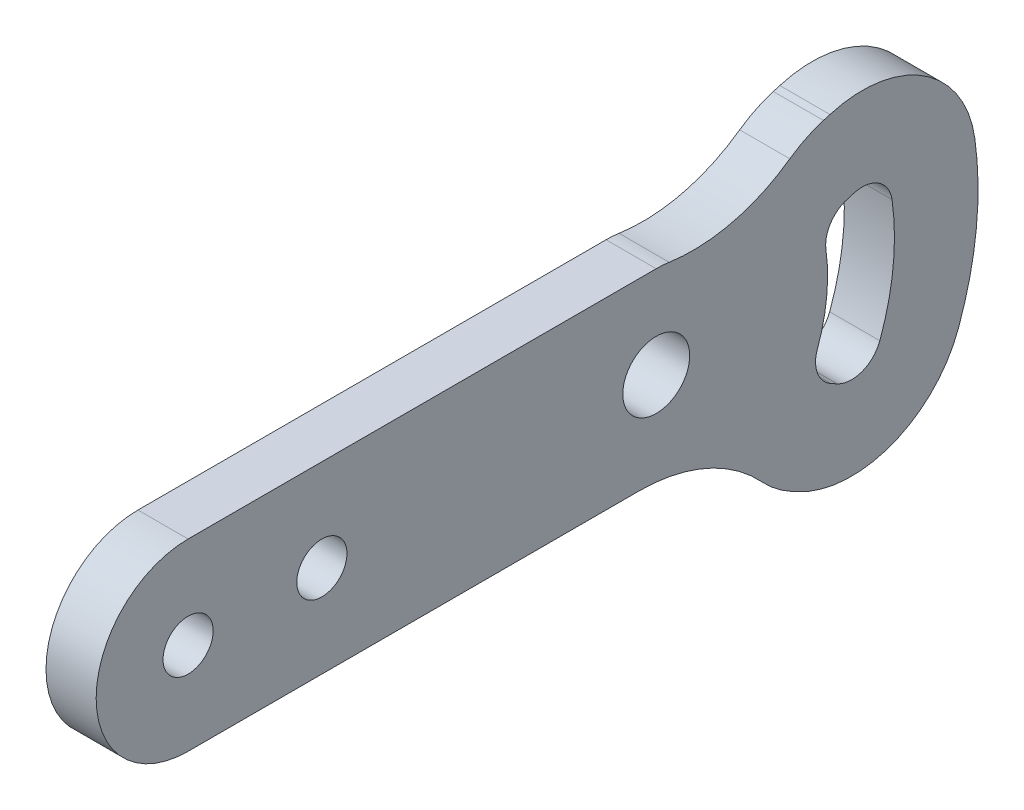
ISO-10303-21;
HEADER;
FILE_DESCRIPTION(('STEP AP214'),'2;1');
FILE_NAME('part.step','',(''),(''),'','','');
FILE_SCHEMA(('AUTOMOTIVE_DESIGN { 1 0 10303 214 1 1 1 1 }'));
ENDSEC;
DATA;
#1=APPLICATION_CONTEXT('core data for automotive mechanical design processes');
#2=APPLICATION_PROTOCOL_DEFINITION('international standard','automotive_design',2000,#1);
#3=PRODUCT_CONTEXT('',#1,'mechanical');
#4=PRODUCT('Part','Part','',(#3));
#5=PRODUCT_RELATED_PRODUCT_CATEGORY('part','',(#4));
#6=PRODUCT_DEFINITION_FORMATION('','',#4);
#7=PRODUCT_DEFINITION_CONTEXT('part definition',#1,'design');
#8=PRODUCT_DEFINITION('design','',#6,#7);
#9=PRODUCT_DEFINITION_SHAPE('','',#8);
#10=(LENGTH_UNIT() NAMED_UNIT(*) SI_UNIT(.MILLI.,.METRE.));
#11=(NAMED_UNIT(*) PLANE_ANGLE_UNIT() SI_UNIT($,.RADIAN.));
#12=(NAMED_UNIT(*) SI_UNIT($,.STERADIAN.) SOLID_ANGLE_UNIT());
#13=UNCERTAINTY_MEASURE_WITH_UNIT(LENGTH_MEASURE(1.E-05),#10,'distance_accuracy_value','');
#14=(GEOMETRIC_REPRESENTATION_CONTEXT(3) GLOBAL_UNCERTAINTY_ASSIGNED_CONTEXT((#13)) GLOBAL_UNIT_ASSIGNED_CONTEXT((#10,
#11,#12)) REPRESENTATION_CONTEXT('',''));
#15=CARTESIAN_POINT('',(0.,0.,0.));
#16=DIRECTION('',(0.,0.,1.));
#17=DIRECTION('',(1.,0.,0.));
#18=AXIS2_PLACEMENT_3D('',#15,#16,#17);
#19=CARTESIAN_POINT('',(3.,-4.10338121412378,-39.3298174129849));
#20=DIRECTION('',(-1.,0.,0.));
#21=DIRECTION('',(0.,0.,1.));
#22=AXIS2_PLACEMENT_3D('',#19,#20,#21);
#23=CYLINDRICAL_SURFACE('',#22,6.79999999999999);
#24=CARTESIAN_POINT('',(3.,-4.10338121412378,-39.3298174129849));
#25=DIRECTION('',(1.,0.,0.));
#26=DIRECTION('',(0.,0.,-1.));
#27=AXIS2_PLACEMENT_3D('',#24,#25,#26);
#28=CIRCLE('',#27,6.79999999999999);
#29=CARTESIAN_POINT('',(3.,-8.71629834174034,-34.3337193781439));
#30=VERTEX_POINT('',#29);
#31=CARTESIAN_POINT('',(3.,-10.0793375802251,-36.0851378432196));
#32=VERTEX_POINT('',#31);
#33=EDGE_CURVE('E299',#30,#32,#28,.T.);
#34=ORIENTED_EDGE('',*,*,#33,.F.);
#35=DIRECTION('',(-1.,0.,0.));
#36=VECTOR('',#35,1.);
#37=CARTESIAN_POINT('',(3.,-8.71629834174034,-34.3337193781439));
#38=LINE('',#37,#36);
#39=CARTESIAN_POINT('',(0.,-8.71629834174034,-34.3337193781439));
#40=VERTEX_POINT('',#39);
#41=EDGE_CURVE('E371',#30,#40,#38,.T.);
#42=ORIENTED_EDGE('',*,*,#41,.T.);
#43=CARTESIAN_POINT('',(0.,-4.10338121412378,-39.3298174129849));
#44=DIRECTION('',(1.,0.,0.));
#45=DIRECTION('',(0.,0.,-1.));
#46=AXIS2_PLACEMENT_3D('',#43,#44,#45);
#47=CIRCLE('',#46,6.79999999999999);
#48=CARTESIAN_POINT('',(0.,-10.0793375802251,-36.0851378432196));
#49=VERTEX_POINT('',#48);
#50=EDGE_CURVE('E339',#40,#49,#47,.T.);
#51=ORIENTED_EDGE('',*,*,#50,.T.);
#52=DIRECTION('',(-1.,0.,0.));
#53=VECTOR('',#52,1.);
#54=CARTESIAN_POINT('',(3.,-10.0793375802251,-36.0851378432196));
#55=LINE('',#54,#53);
#56=EDGE_CURVE('E368',#32,#49,#55,.T.);
#57=ORIENTED_EDGE('',*,*,#56,.F.);
#58=EDGE_LOOP('',(#34,#42,#51,#57));
#59=FACE_BOUND('',#58,.T.);
#60=ADVANCED_FACE('F116',(#59),#23,.T.);
#61=CARTESIAN_POINT('',(3.,7.34730238792617,-3.98925970849164));
#62=DIRECTION('',(0.,0.878817112661964,-0.477158760259611));
#63=DIRECTION('',(0.,0.477158760259611,0.878817112661964));
#64=AXIS2_PLACEMENT_3D('',#61,#62,#63);
#65=PLANE('',#64);
#66=DIRECTION('',(0.,-0.477158760259611,-0.878817112661964));
#67=VECTOR('',#66,1.);
#68=CARTESIAN_POINT('',(0.,7.34730238792617,-3.98925970849164));
#69=LINE('',#68,#67);
#70=CARTESIAN_POINT('',(0.,-10.2722961094085,-36.4405232444814));
#71=VERTEX_POINT('',#70);
#72=EDGE_CURVE('E341',#49,#71,#69,.T.);
#73=ORIENTED_EDGE('',*,*,#72,.T.);
#74=DIRECTION('',(-1.,0.,0.));
#75=VECTOR('',#74,1.);
#76=CARTESIAN_POINT('',(3.,-10.2722961094085,-36.4405232444814));
#77=LINE('',#76,#75);
#78=CARTESIAN_POINT('',(3.,-10.2722961094085,-36.4405232444814));
#79=VERTEX_POINT('',#78);
#80=EDGE_CURVE('E365',#79,#71,#77,.T.);
#81=ORIENTED_EDGE('',*,*,#80,.F.);
#82=DIRECTION('',(0.,-0.477158760259611,-0.878817112661964));
#83=VECTOR('',#82,1.);
#84=CARTESIAN_POINT('',(3.,7.34730238792617,-3.98925970849164));
#85=LINE('',#84,#83);
#86=EDGE_CURVE('E301',#32,#79,#85,.T.);
#87=ORIENTED_EDGE('',*,*,#86,.F.);
#88=ORIENTED_EDGE('',*,*,#56,.T.);
#89=EDGE_LOOP('',(#73,#81,#87,#88));
#90=FACE_BOUND('',#89,.T.);
#91=ADVANCED_FACE('F492',(#90),#65,.F.);
#92=CARTESIAN_POINT('',(3.,-4.29633974330718,-39.6852028142467));
#93=DIRECTION('',(-1.,0.,0.));
#94=DIRECTION('',(0.,0.,1.));
#95=AXIS2_PLACEMENT_3D('',#92,#93,#94);
#96=CYLINDRICAL_SURFACE('',#95,6.8);
#97=CARTESIAN_POINT('',(0.,-4.29633974330718,-39.6852028142467));
#98=DIRECTION('',(1.,0.,0.));
#99=DIRECTION('',(0.,0.,-1.));
#100=AXIS2_PLACEMENT_3D('',#97,#98,#99);
#101=CIRCLE('',#100,6.8);
#102=CARTESIAN_POINT('',(0.,-6.64293494447094,-46.0674822629919));
#103=VERTEX_POINT('',#102);
#104=EDGE_CURVE('E344',#71,#103,#101,.T.);
#105=ORIENTED_EDGE('',*,*,#104,.T.);
#106=DIRECTION('',(-1.,0.,0.));
#107=VECTOR('',#106,1.);
#108=CARTESIAN_POINT('',(3.,-6.64293494447094,-46.0674822629919));
#109=LINE('',#108,#107);
#110=CARTESIAN_POINT('',(3.,-6.64293494447094,-46.0674822629919));
#111=VERTEX_POINT('',#110);
#112=EDGE_CURVE('E362',#111,#103,#109,.T.);
#113=ORIENTED_EDGE('',*,*,#112,.F.);
#114=CARTESIAN_POINT('',(3.,-4.29633974330718,-39.6852028142467));
#115=DIRECTION('',(1.,0.,0.));
#116=DIRECTION('',(0.,0.,-1.));
#117=AXIS2_PLACEMENT_3D('',#114,#115,#116);
#118=CIRCLE('',#117,6.8);
#119=EDGE_CURVE('E304',#79,#111,#118,.T.);
#120=ORIENTED_EDGE('',*,*,#119,.F.);
#121=ORIENTED_EDGE('',*,*,#80,.T.);
#122=EDGE_LOOP('',(#105,#113,#120,#121));
#123=FACE_BOUND('',#122,.T.);
#124=ADVANCED_FACE('F489',(#123),#96,.T.);
#125=CARTESIAN_POINT('',(3.,0.,-28.));
#126=DIRECTION('',(-1.,0.,0.));
#127=DIRECTION('',(0.,0.,1.));
#128=AXIS2_PLACEMENT_3D('',#125,#126,#127);
#129=CYLINDRICAL_SURFACE('',#128,19.25);
#130=CARTESIAN_POINT('',(0.,0.,-28.));
#131=DIRECTION('',(1.,0.,0.));
#132=DIRECTION('',(0.,0.,-1.));
#133=AXIS2_PLACEMENT_3D('',#130,#131,#132);
#134=CIRCLE('',#133,19.25);
#135=CARTESIAN_POINT('',(0.,2.74133009164647,-47.0538082631435));
#136=VERTEX_POINT('',#135);
#137=EDGE_CURVE('E347',#103,#136,#134,.T.);
#138=ORIENTED_EDGE('',*,*,#137,.T.);
#139=DIRECTION('',(-1.,0.,0.));
#140=VECTOR('',#139,1.);
#141=CARTESIAN_POINT('',(3.,2.74133009164647,-47.0538082631435));
#142=LINE('',#141,#140);
#143=CARTESIAN_POINT('',(3.,2.74133009164647,-47.0538082631435));
#144=VERTEX_POINT('',#143);
#145=EDGE_CURVE('E360',#144,#136,#142,.T.);
#146=ORIENTED_EDGE('',*,*,#145,.F.);
#147=CARTESIAN_POINT('',(3.,0.,-28.));
#148=DIRECTION('',(1.,0.,0.));
#149=DIRECTION('',(0.,0.,-1.));
#150=AXIS2_PLACEMENT_3D('',#147,#148,#149);
#151=CIRCLE('',#150,19.25);
#152=EDGE_CURVE('E307',#111,#144,#151,.T.);
#153=ORIENTED_EDGE('',*,*,#152,.F.);
#154=ORIENTED_EDGE('',*,*,#112,.T.);
#155=EDGE_LOOP('',(#138,#146,#153,#154));
#156=FACE_BOUND('',#155,.T.);
#157=ADVANCED_FACE('F487',(#156),#129,.T.);
#158=CARTESIAN_POINT('',(3.,1.77296413719473,-40.3231123572019));
#159=DIRECTION('',(-1.,0.,0.));
#160=DIRECTION('',(0.,0.,1.));
#161=AXIS2_PLACEMENT_3D('',#158,#159,#160);
#162=CYLINDRICAL_SURFACE('',#161,6.8);
#163=CARTESIAN_POINT('',(0.,1.77296413719473,-40.3231123572019));
#164=DIRECTION('',(1.,0.,0.));
#165=DIRECTION('',(0.,0.,-1.));
#166=AXIS2_PLACEMENT_3D('',#163,#164,#165);
#167=CIRCLE('',#166,6.8);
#168=CARTESIAN_POINT('',(0.,8.29293833429844,-38.3918080132152));
#169=VERTEX_POINT('',#168);
#170=EDGE_CURVE('E350',#169,#136,#167,.F.);
#171=ORIENTED_EDGE('',*,*,#170,.F.);
#172=DIRECTION('',(-1.,0.,0.));
#173=VECTOR('',#172,1.);
#174=CARTESIAN_POINT('',(3.,8.29293833429844,-38.3918080132152));
#175=LINE('',#174,#173);
#176=CARTESIAN_POINT('',(3.,8.29293833429844,-38.3918080132152));
#177=VERTEX_POINT('',#176);
#178=EDGE_CURVE('E358',#177,#169,#175,.T.);
#179=ORIENTED_EDGE('',*,*,#178,.F.);
#180=CARTESIAN_POINT('',(3.,1.77296413719473,-40.3231123572019));
#181=DIRECTION('',(1.,0.,0.));
#182=DIRECTION('',(0.,0.,-1.));
#183=AXIS2_PLACEMENT_3D('',#180,#181,#182);
#184=CIRCLE('',#183,6.8);
#185=EDGE_CURVE('E309',#177,#144,#184,.F.);
#186=ORIENTED_EDGE('',*,*,#185,.T.);
#187=ORIENTED_EDGE('',*,*,#145,.T.);
#188=EDGE_LOOP('',(#171,#179,#186,#187));
#189=FACE_BOUND('',#188,.T.);
#190=ADVANCED_FACE('F483',(#189),#162,.T.);
#191=CARTESIAN_POINT('',(3.,-2.83084781586939,-0.838535325244442));
#192=DIRECTION('',(0.,0.958819734868193,0.284015344703922));
#193=DIRECTION('',(0.,-0.284015344703922,0.958819734868193));
#194=AXIS2_PLACEMENT_3D('',#191,#192,#193);
#195=PLANE('',#194);
#196=DIRECTION('',(0.,0.284015344703922,-0.958819734868193));
#197=VECTOR('',#196,1.);
#198=CARTESIAN_POINT('',(0.,-2.83084781586939,-0.838535325244442));
#199=LINE('',#198,#197);
#200=CARTESIAN_POINT('',(0.,8.17808519160487,-38.0040703015749));
#201=VERTEX_POINT('',#200);
#202=EDGE_CURVE('E353',#201,#169,#199,.T.);
#203=ORIENTED_EDGE('',*,*,#202,.F.);
#204=DIRECTION('',(-1.,0.,0.));
#205=VECTOR('',#204,1.);
#206=CARTESIAN_POINT('',(3.,8.17808519160487,-38.0040703015749));
#207=LINE('',#206,#205);
#208=CARTESIAN_POINT('',(3.,8.17808519160487,-38.0040703015749));
#209=VERTEX_POINT('',#208);
#210=EDGE_CURVE('E270',#209,#201,#207,.T.);
#211=ORIENTED_EDGE('',*,*,#210,.F.);
#212=DIRECTION('',(0.,0.284015344703922,-0.958819734868193));
#213=VECTOR('',#212,1.);
#214=CARTESIAN_POINT('',(3.,-2.83084781586939,-0.838535325244442));
#215=LINE('',#214,#213);
#216=EDGE_CURVE('E312',#209,#177,#215,.T.);
#217=ORIENTED_EDGE('',*,*,#216,.T.);
#218=ORIENTED_EDGE('',*,*,#178,.T.);
#219=EDGE_LOOP('',(#203,#211,#217,#218));
#220=FACE_BOUND('',#219,.T.);
#221=ADVANCED_FACE('F480',(#220),#195,.T.);
#222=CARTESIAN_POINT('',(3.,1.65811099450116,-39.9353746455616));
#223=DIRECTION('',(-1.,0.,0.));
#224=DIRECTION('',(0.,0.,1.));
#225=AXIS2_PLACEMENT_3D('',#222,#223,#224);
#226=CYLINDRICAL_SURFACE('',#225,6.8);
#227=CARTESIAN_POINT('',(0.,1.65811099450116,-39.9353746455616));
#228=DIRECTION('',(1.,0.,0.));
#229=DIRECTION('',(0.,0.,-1.));
#230=AXIS2_PLACEMENT_3D('',#227,#228,#229);
#231=CIRCLE('',#230,6.8);
#232=CARTESIAN_POINT('',(0.,7.19771983883198,-35.9916791892907));
#233=VERTEX_POINT('',#232);
#234=EDGE_CURVE('E282',#201,#233,#231,.T.);
#235=ORIENTED_EDGE('',*,*,#234,.T.);
#236=DIRECTION('',(-1.,0.,0.));
#237=VECTOR('',#236,1.);
#238=CARTESIAN_POINT('',(3.,7.19771983883197,-35.9916791892907));
#239=LINE('',#238,#237);
#240=CARTESIAN_POINT('',(3.,7.19771983883198,-35.9916791892907));
#241=VERTEX_POINT('',#240);
#242=EDGE_CURVE('E131',#233,#241,#239,.F.);
#243=ORIENTED_EDGE('',*,*,#242,.T.);
#244=CARTESIAN_POINT('',(3.,1.65811099450116,-39.9353746455616));
#245=DIRECTION('',(1.,0.,0.));
#246=DIRECTION('',(0.,0.,-1.));
#247=AXIS2_PLACEMENT_3D('',#244,#245,#246);
#248=CIRCLE('',#247,6.8);
#249=EDGE_CURVE('E315',#209,#241,#248,.T.);
#250=ORIENTED_EDGE('',*,*,#249,.F.);
#251=ORIENTED_EDGE('',*,*,#210,.T.);
#252=EDGE_LOOP('',(#235,#243,#250,#251));
#253=FACE_BOUND('',#252,.T.);
#254=ADVANCED_FACE('F477',(#253),#226,.T.);
#255=CARTESIAN_POINT('',(3.,11.7413879512359,-6.37505350978958));
#256=DIRECTION('',(0.,0.878817112661966,-0.477158760259608));
#257=DIRECTION('',(0.,0.477158760259608,0.878817112661966));
#258=AXIS2_PLACEMENT_3D('',#255,#256,#257);
#259=PLANE('',#258);
#260=DIRECTION('',(0.,-0.477158760259608,-0.878817112661966));
#261=VECTOR('',#260,1.);
#262=CARTESIAN_POINT('',(0.,11.7413879512359,-6.37505350978958));
#263=LINE('',#262,#261);
#264=CARTESIAN_POINT('',(0.,-5.68525201691532,-38.4709316445176));
#265=VERTEX_POINT('',#264);
#266=CARTESIAN_POINT('',(0.,-5.87821054609872,-38.8263170457794));
#267=VERTEX_POINT('',#266);
#268=EDGE_CURVE('E319',#265,#267,#263,.T.);
#269=ORIENTED_EDGE('',*,*,#268,.F.);
#270=DIRECTION('',(-1.,0.,0.));
#271=VECTOR('',#270,1.);
#272=CARTESIAN_POINT('',(3.,-5.68525201691532,-38.4709316445176));
#273=LINE('',#272,#271);
#274=CARTESIAN_POINT('',(3.,-5.68525201691532,-38.4709316445176));
#275=VERTEX_POINT('',#274);
#276=EDGE_CURVE('E271',#275,#265,#273,.T.);
#277=ORIENTED_EDGE('',*,*,#276,.F.);
#278=DIRECTION('',(0.,-0.477158760259608,-0.878817112661966));
#279=VECTOR('',#278,1.);
#280=CARTESIAN_POINT('',(3.,11.7413879512359,-6.37505350978958));
#281=LINE('',#280,#279);
#282=CARTESIAN_POINT('',(3.,-5.87821054609872,-38.8263170457794));
#283=VERTEX_POINT('',#282);
#284=EDGE_CURVE('E278',#275,#283,#281,.T.);
#285=ORIENTED_EDGE('',*,*,#284,.T.);
#286=DIRECTION('',(-1.,0.,0.));
#287=VECTOR('',#286,1.);
#288=CARTESIAN_POINT('',(3.,-5.87821054609872,-38.8263170457794));
#289=LINE('',#288,#287);
#290=EDGE_CURVE('E259',#283,#267,#289,.T.);
#291=ORIENTED_EDGE('',*,*,#290,.T.);
#292=EDGE_LOOP('',(#269,#277,#285,#291));
#293=FACE_BOUND('',#292,.T.);
#294=ADVANCED_FACE('F284',(#293),#259,.T.);
#295=CARTESIAN_POINT('',(3.,-4.10338121412378,-39.3298174129849));
#296=DIRECTION('',(-1.,0.,0.));
#297=DIRECTION('',(0.,0.,1.));
#298=AXIS2_PLACEMENT_3D('',#295,#296,#297);
#299=CYLINDRICAL_SURFACE('',#298,1.8);
#300=CARTESIAN_POINT('',(0.,-4.10338121412378,-39.3298174129849));
#301=DIRECTION('',(1.,0.,0.));
#302=DIRECTION('',(0.,0.,-1.));
#303=AXIS2_PLACEMENT_3D('',#300,#301,#302);
#304=CIRCLE('',#303,1.8);
#305=CARTESIAN_POINT('',(0.,-3.49042800371525,-37.6373965546137));
#306=VERTEX_POINT('',#305);
#307=EDGE_CURVE('E322',#306,#265,#304,.T.);
#308=ORIENTED_EDGE('',*,*,#307,.F.);
#309=DIRECTION('',(-1.,0.,0.));
#310=VECTOR('',#309,1.);
#311=CARTESIAN_POINT('',(3.,-3.49042800371525,-37.6373965546137));
#312=LINE('',#311,#310);
#313=CARTESIAN_POINT('',(3.,-3.49042800371525,-37.6373965546137));
#314=VERTEX_POINT('',#313);
#315=EDGE_CURVE('E382',#314,#306,#312,.T.);
#316=ORIENTED_EDGE('',*,*,#315,.F.);
#317=CARTESIAN_POINT('',(3.,-4.10338121412378,-39.3298174129849));
#318=DIRECTION('',(1.,0.,0.));
#319=DIRECTION('',(0.,0.,-1.));
#320=AXIS2_PLACEMENT_3D('',#317,#318,#319);
#321=CIRCLE('',#320,1.8);
#322=EDGE_CURVE('E285',#314,#275,#321,.T.);
#323=ORIENTED_EDGE('',*,*,#322,.T.);
#324=ORIENTED_EDGE('',*,*,#276,.T.);
#325=EDGE_LOOP('',(#308,#316,#323,#324));
#326=FACE_BOUND('',#325,.T.);
#327=ADVANCED_FACE('F522',(#326),#299,.F.);
#328=CARTESIAN_POINT('',(3.,0.,-28.));
#329=DIRECTION('',(-1.,0.,0.));
#330=DIRECTION('',(0.,0.,1.));
#331=AXIS2_PLACEMENT_3D('',#328,#329,#330);
#332=CYLINDRICAL_SURFACE('',#331,10.25);
#333=CARTESIAN_POINT('',(0.,0.,-28.));
#334=DIRECTION('',(1.,0.,0.));
#335=DIRECTION('',(0.,0.,-1.));
#336=AXIS2_PLACEMENT_3D('',#333,#334,#335);
#337=CIRCLE('',#336,10.25);
#338=CARTESIAN_POINT('',(0.,1.41042636461717,-38.1524971051457));
#339=VERTEX_POINT('',#338);
#340=EDGE_CURVE('E325',#306,#339,#337,.T.);
#341=ORIENTED_EDGE('',*,*,#340,.T.);
#342=DIRECTION('',(-1.,0.,0.));
#343=VECTOR('',#342,1.);
#344=CARTESIAN_POINT('',(3.,1.41042636461717,-38.1524971051457));
#345=LINE('',#344,#343);
#346=CARTESIAN_POINT('',(3.,1.41042636461717,-38.1524971051457));
#347=VERTEX_POINT('',#346);
#348=EDGE_CURVE('E380',#347,#339,#345,.T.);
#349=ORIENTED_EDGE('',*,*,#348,.F.);
#350=CARTESIAN_POINT('',(3.,0.,-28.));
#351=DIRECTION('',(1.,0.,0.));
#352=DIRECTION('',(0.,0.,-1.));
#353=AXIS2_PLACEMENT_3D('',#350,#351,#352);
#354=CIRCLE('',#353,10.25);
#355=EDGE_CURVE('E287',#314,#347,#354,.T.);
#356=ORIENTED_EDGE('',*,*,#355,.F.);
#357=ORIENTED_EDGE('',*,*,#315,.T.);
#358=EDGE_LOOP('',(#341,#349,#356,#357));
#359=FACE_BOUND('',#358,.T.);
#360=ADVANCED_FACE('F518',(#359),#332,.T.);
#361=CARTESIAN_POINT('',(3.,1.65811099450116,-39.9353746455616));
#362=DIRECTION('',(-1.,0.,0.));
#363=DIRECTION('',(0.,0.,1.));
#364=AXIS2_PLACEMENT_3D('',#361,#362,#363);
#365=CYLINDRICAL_SURFACE('',#364,1.8);
#366=CARTESIAN_POINT('',(0.,1.65811099450116,-39.9353746455616));
#367=DIRECTION('',(1.,0.,0.));
#368=DIRECTION('',(0.,0.,-1.));
#369=AXIS2_PLACEMENT_3D('',#366,#367,#368);
#370=CIRCLE('',#369,1.8);
#371=CARTESIAN_POINT('',(0.,3.3839865172639,-39.4241470250945));
#372=VERTEX_POINT('',#371);
#373=EDGE_CURVE('E328',#372,#339,#370,.T.);
#374=ORIENTED_EDGE('',*,*,#373,.F.);
#375=DIRECTION('',(-1.,0.,0.));
#376=VECTOR('',#375,1.);
#377=CARTESIAN_POINT('',(3.,3.3839865172639,-39.4241470250945));
#378=LINE('',#377,#376);
#379=CARTESIAN_POINT('',(3.,3.3839865172639,-39.4241470250945));
#380=VERTEX_POINT('',#379);
#381=EDGE_CURVE('E378',#380,#372,#378,.T.);
#382=ORIENTED_EDGE('',*,*,#381,.F.);
#383=CARTESIAN_POINT('',(3.,1.65811099450116,-39.9353746455616));
#384=DIRECTION('',(1.,0.,0.));
#385=DIRECTION('',(0.,0.,-1.));
#386=AXIS2_PLACEMENT_3D('',#383,#384,#385);
#387=CIRCLE('',#386,1.8);
#388=EDGE_CURVE('E291',#380,#347,#387,.T.);
#389=ORIENTED_EDGE('',*,*,#388,.T.);
#390=ORIENTED_EDGE('',*,*,#348,.T.);
#391=EDGE_LOOP('',(#374,#382,#389,#390));
#392=FACE_BOUND('',#391,.T.);
#393=ADVANCED_FACE('F514',(#392),#365,.F.);
#394=CARTESIAN_POINT('',(3.,-7.62494649021036,-2.25861204876405));
#395=DIRECTION('',(0.,0.958819734868193,0.284015344703922));
#396=DIRECTION('',(0.,-0.284015344703922,0.958819734868193));
#397=AXIS2_PLACEMENT_3D('',#394,#395,#396);
#398=PLANE('',#397);
#399=DIRECTION('',(0.,0.284015344703922,-0.958819734868193));
#400=VECTOR('',#399,1.);
#401=CARTESIAN_POINT('',(0.,-7.62494649021036,-2.25861204876405));
#402=LINE('',#401,#400);
#403=CARTESIAN_POINT('',(0.,3.49883965995747,-39.8118847367348));
#404=VERTEX_POINT('',#403);
#405=EDGE_CURVE('E331',#372,#404,#402,.T.);
#406=ORIENTED_EDGE('',*,*,#405,.T.);
#407=DIRECTION('',(-1.,0.,0.));
#408=VECTOR('',#407,1.);
#409=CARTESIAN_POINT('',(3.,3.49883965995747,-39.8118847367348));
#410=LINE('',#409,#408);
#411=CARTESIAN_POINT('',(3.,3.49883965995747,-39.8118847367348));
#412=VERTEX_POINT('',#411);
#413=EDGE_CURVE('E375',#412,#404,#410,.T.);
#414=ORIENTED_EDGE('',*,*,#413,.F.);
#415=DIRECTION('',(0.,0.284015344703922,-0.958819734868193));
#416=VECTOR('',#415,1.);
#417=CARTESIAN_POINT('',(3.,-7.62494649021036,-2.25861204876405));
#418=LINE('',#417,#416);
#419=EDGE_CURVE('E294',#380,#412,#418,.T.);
#420=ORIENTED_EDGE('',*,*,#419,.F.);
#421=ORIENTED_EDGE('',*,*,#381,.T.);
#422=EDGE_LOOP('',(#406,#414,#420,#421));
#423=FACE_BOUND('',#422,.T.);
#424=ADVANCED_FACE('F510',(#423),#398,.F.);
#425=CARTESIAN_POINT('',(3.,1.77296413719473,-40.3231123572019));
#426=DIRECTION('',(-1.,0.,0.));
#427=DIRECTION('',(0.,0.,1.));
#428=AXIS2_PLACEMENT_3D('',#425,#426,#427);
#429=CYLINDRICAL_SURFACE('',#428,1.8);
#430=CARTESIAN_POINT('',(0.,1.77296413719473,-40.3231123572019));
#431=DIRECTION('',(1.,0.,0.));
#432=DIRECTION('',(0.,0.,-1.));
#433=AXIS2_PLACEMENT_3D('',#430,#431,#432);
#434=CIRCLE('',#433,1.8);
#435=CARTESIAN_POINT('',(0.,2.02929630160842,-42.1047671558335));
#436=VERTEX_POINT('',#435);
#437=EDGE_CURVE('E333',#404,#436,#434,.F.);
#438=ORIENTED_EDGE('',*,*,#437,.T.);
#439=DIRECTION('',(-1.,0.,0.));
#440=VECTOR('',#439,1.);
#441=CARTESIAN_POINT('',(3.,2.02929630160842,-42.1047671558335));
#442=LINE('',#441,#440);
#443=CARTESIAN_POINT('',(3.,2.02929630160842,-42.1047671558335));
#444=VERTEX_POINT('',#443);
#445=EDGE_CURVE('E373',#444,#436,#442,.T.);
#446=ORIENTED_EDGE('',*,*,#445,.F.);
#447=CARTESIAN_POINT('',(3.,1.77296413719473,-40.3231123572019));
#448=DIRECTION('',(1.,0.,0.));
#449=DIRECTION('',(0.,0.,-1.));
#450=AXIS2_PLACEMENT_3D('',#447,#448,#449);
#451=CIRCLE('',#450,1.8);
#452=EDGE_CURVE('E296',#412,#444,#451,.F.);
#453=ORIENTED_EDGE('',*,*,#452,.F.);
#454=ORIENTED_EDGE('',*,*,#413,.T.);
#455=EDGE_LOOP('',(#438,#446,#453,#454));
#456=FACE_BOUND('',#455,.T.);
#457=ADVANCED_FACE('F506',(#456),#429,.F.);
#458=CARTESIAN_POINT('',(3.,0.,-28.));
#459=DIRECTION('',(-1.,0.,0.));
#460=DIRECTION('',(0.,0.,1.));
#461=AXIS2_PLACEMENT_3D('',#458,#459,#460);
#462=CYLINDRICAL_SURFACE('',#461,14.25);
#463=CARTESIAN_POINT('',(0.,0.,-28.));
#464=DIRECTION('',(1.,0.,0.));
#465=DIRECTION('',(0.,0.,-1.));
#466=AXIS2_PLACEMENT_3D('',#463,#464,#465);
#467=CIRCLE('',#466,14.25);
#468=CARTESIAN_POINT('',(0.,-4.91749729655642,-41.3746297271499));
#469=VERTEX_POINT('',#468);
#470=EDGE_CURVE('E336',#469,#436,#467,.T.);
#471=ORIENTED_EDGE('',*,*,#470,.F.);
#472=DIRECTION('',(-1.,0.,0.));
#473=VECTOR('',#472,1.);
#474=CARTESIAN_POINT('',(3.,-4.91749729655642,-41.3746297271499));
#475=LINE('',#474,#473);
#476=CARTESIAN_POINT('',(3.,-4.91749729655642,-41.3746297271499));
#477=VERTEX_POINT('',#476);
#478=EDGE_CURVE('E317',#477,#469,#475,.T.);
#479=ORIENTED_EDGE('',*,*,#478,.F.);
#480=CARTESIAN_POINT('',(3.,0.,-28.));
#481=DIRECTION('',(1.,0.,0.));
#482=DIRECTION('',(0.,0.,-1.));
#483=AXIS2_PLACEMENT_3D('',#480,#481,#482);
#484=CIRCLE('',#483,14.25);
#485=EDGE_CURVE('E281',#477,#444,#484,.T.);
#486=ORIENTED_EDGE('',*,*,#485,.T.);
#487=ORIENTED_EDGE('',*,*,#445,.T.);
#488=EDGE_LOOP('',(#471,#479,#486,#487));
#489=FACE_BOUND('',#488,.T.);
#490=ADVANCED_FACE('F503',(#489),#462,.F.);
#491=CARTESIAN_POINT('',(3.,-4.29633974330718,-39.6852028142467));
#492=DIRECTION('',(-1.,0.,0.));
#493=DIRECTION('',(0.,0.,1.));
#494=AXIS2_PLACEMENT_3D('',#491,#492,#493);
#495=CYLINDRICAL_SURFACE('',#494,1.8);
#496=CARTESIAN_POINT('',(0.,-4.29633974330718,-39.6852028142467));
#497=DIRECTION('',(1.,0.,0.));
#498=DIRECTION('',(0.,0.,-1.));
#499=AXIS2_PLACEMENT_3D('',#496,#497,#498);
#500=CIRCLE('',#499,1.8);
#501=EDGE_CURVE('E265',#267,#469,#500,.T.);
#502=ORIENTED_EDGE('',*,*,#501,.F.);
#503=ORIENTED_EDGE('',*,*,#290,.F.);
#504=CARTESIAN_POINT('',(3.,-4.29633974330718,-39.6852028142467));
#505=DIRECTION('',(1.,0.,0.));
#506=DIRECTION('',(0.,0.,-1.));
#507=AXIS2_PLACEMENT_3D('',#504,#505,#506);
#508=CIRCLE('',#507,1.8);
#509=EDGE_CURVE('E262',#283,#477,#508,.T.);
#510=ORIENTED_EDGE('',*,*,#509,.T.);
#511=ORIENTED_EDGE('',*,*,#478,.T.);
#512=EDGE_LOOP('',(#502,#503,#510,#511));
#513=FACE_BOUND('',#512,.T.);
#514=ADVANCED_FACE('F261',(#513),#495,.F.);
#515=CARTESIAN_POINT('',(0.,0.,0.));
#516=DIRECTION('',(1.,0.,0.));
#517=DIRECTION('',(0.,0.,-1.));
#518=AXIS2_PLACEMENT_3D('',#515,#516,#517);
#519=PLANE('',#518);
#520=ORIENTED_EDGE('',*,*,#501,.T.);
#521=ORIENTED_EDGE('',*,*,#470,.T.);
#522=ORIENTED_EDGE('',*,*,#437,.F.);
#523=ORIENTED_EDGE('',*,*,#405,.F.);
#524=ORIENTED_EDGE('',*,*,#373,.T.);
#525=ORIENTED_EDGE('',*,*,#340,.F.);
#526=ORIENTED_EDGE('',*,*,#307,.T.);
#527=ORIENTED_EDGE('',*,*,#268,.T.);
#528=EDGE_LOOP('',(#520,#521,#522,#523,#524,#525,#526,#527));
#529=FACE_BOUND('',#528,.T.);
#530=ORIENTED_EDGE('',*,*,#50,.F.);
#531=CARTESIAN_POINT('',(0.,-15.5,-26.9865163857307));
#532=DIRECTION('',(1.,0.,0.));
#533=DIRECTION('',(0.,0.,-1.));
#534=AXIS2_PLACEMENT_3D('',#531,#532,#533);
#535=CIRCLE('',#534,10.);
#536=CARTESIAN_POINT('',(0.,-5.5,-26.9865163857307));
#537=VERTEX_POINT('',#536);
#538=EDGE_CURVE('E438',#40,#537,#535,.T.);
#539=ORIENTED_EDGE('',*,*,#538,.T.);
#540=DIRECTION('',(0.,0.,-1.));
#541=VECTOR('',#540,1.);
#542=CARTESIAN_POINT('',(0.,-5.5,0.));
#543=LINE('',#542,#541);
#544=CARTESIAN_POINT('',(0.,-5.5,0.));
#545=VERTEX_POINT('',#544);
#546=EDGE_CURVE('E401',#545,#537,#543,.T.);
#547=ORIENTED_EDGE('',*,*,#546,.F.);
#548=CARTESIAN_POINT('',(0.,0.,0.));
#549=DIRECTION('',(1.,0.,0.));
#550=DIRECTION('',(0.,0.,-1.));
#551=AXIS2_PLACEMENT_3D('',#548,#549,#550);
#552=CIRCLE('',#551,5.5);
#553=CARTESIAN_POINT('',(0.,5.5,0.));
#554=VERTEX_POINT('',#553);
#555=EDGE_CURVE('E408',#554,#545,#552,.T.);
#556=ORIENTED_EDGE('',*,*,#555,.F.);
#557=DIRECTION('',(0.,0.,-1.));
#558=VECTOR('',#557,1.);
#559=CARTESIAN_POINT('',(0.,5.5,0.));
#560=LINE('',#559,#558);
#561=CARTESIAN_POINT('',(0.,5.5,-28.));
#562=VERTEX_POINT('',#561);
#563=EDGE_CURVE('E420',#554,#562,#560,.T.);
#564=ORIENTED_EDGE('',*,*,#563,.T.);
#565=CARTESIAN_POINT('',(0.,0.,-28.));
#566=DIRECTION('',(1.,0.,0.));
#567=DIRECTION('',(0.,0.,-1.));
#568=AXIS2_PLACEMENT_3D('',#565,#566,#567);
#569=CIRCLE('',#568,5.5);
#570=CARTESIAN_POINT('',(0.,5.4447173473483,-28.7778515330604));
#571=VERTEX_POINT('',#570);
#572=EDGE_CURVE('E418',#571,#562,#569,.T.);
#573=ORIENTED_EDGE('',*,*,#572,.F.);
#574=CARTESIAN_POINT('',(0.,15.3442034334361,-30.1921270477158));
#575=DIRECTION('',(1.,0.,0.));
#576=DIRECTION('',(0.,0.,-1.));
#577=AXIS2_PLACEMENT_3D('',#574,#575,#576);
#578=CIRCLE('',#577,10.);
#579=EDGE_CURVE('E124',#571,#233,#578,.T.);
#580=ORIENTED_EDGE('',*,*,#579,.T.);
#581=ORIENTED_EDGE('',*,*,#234,.F.);
#582=ORIENTED_EDGE('',*,*,#202,.T.);
#583=ORIENTED_EDGE('',*,*,#170,.T.);
#584=ORIENTED_EDGE('',*,*,#137,.F.);
#585=ORIENTED_EDGE('',*,*,#104,.F.);
#586=ORIENTED_EDGE('',*,*,#72,.F.);
#587=EDGE_LOOP('',(#530,#539,#547,#556,#564,#573,#580,#581,#582,#583,#584,#585,#586));
#588=FACE_BOUND('',#587,.T.);
#589=CARTESIAN_POINT('',(0.,0.,-8.));
#590=DIRECTION('',(1.,0.,0.));
#591=DIRECTION('',(0.,0.,-1.));
#592=AXIS2_PLACEMENT_3D('',#589,#590,#591);
#593=CIRCLE('',#592,1.5);
#594=CARTESIAN_POINT('',(0.,0.,-9.5));
#595=VERTEX_POINT('',#594);
#596=EDGE_CURVE('E395',#595,#595,#593,.T.);
#597=ORIENTED_EDGE('',*,*,#596,.T.);
#598=EDGE_LOOP('',(#597));
#599=FACE_BOUND('',#598,.T.);
#600=CARTESIAN_POINT('',(0.,0.,0.));
#601=DIRECTION('',(1.,0.,0.));
#602=DIRECTION('',(0.,0.,-1.));
#603=AXIS2_PLACEMENT_3D('',#600,#601,#602);
#604=CIRCLE('',#603,1.5);
#605=CARTESIAN_POINT('',(0.,0.,-1.5));
#606=VERTEX_POINT('',#605);
#607=EDGE_CURVE('E388',#606,#606,#604,.T.);
#608=ORIENTED_EDGE('',*,*,#607,.T.);
#609=EDGE_LOOP('',(#608));
#610=FACE_BOUND('',#609,.T.);
#611=CARTESIAN_POINT('',(0.,0.,-28.));
#612=DIRECTION('',(1.,0.,0.));
#613=DIRECTION('',(0.,0.,-1.));
#614=AXIS2_PLACEMENT_3D('',#611,#612,#613);
#615=CIRCLE('',#614,2.);
#616=CARTESIAN_POINT('',(0.,0.,-30.));
#617=VERTEX_POINT('',#616);
#618=EDGE_CURVE('E389',#617,#617,#615,.T.);
#619=ORIENTED_EDGE('',*,*,#618,.T.);
#620=EDGE_LOOP('',(#619));
#621=FACE_BOUND('',#620,.T.);
#622=ADVANCED_FACE('F454',(#529,#588,#599,#610,#621),#519,.F.);
#623=CARTESIAN_POINT('',(3.,0.,0.));
#624=DIRECTION('',(1.,0.,0.));
#625=DIRECTION('',(0.,0.,-1.));
#626=AXIS2_PLACEMENT_3D('',#623,#624,#625);
#627=PLANE('',#626);
#628=ORIENTED_EDGE('',*,*,#509,.F.);
#629=ORIENTED_EDGE('',*,*,#284,.F.);
#630=ORIENTED_EDGE('',*,*,#322,.F.);
#631=ORIENTED_EDGE('',*,*,#355,.T.);
#632=ORIENTED_EDGE('',*,*,#388,.F.);
#633=ORIENTED_EDGE('',*,*,#419,.T.);
#634=ORIENTED_EDGE('',*,*,#452,.T.);
#635=ORIENTED_EDGE('',*,*,#485,.F.);
#636=EDGE_LOOP('',(#628,#629,#630,#631,#632,#633,#634,#635));
#637=FACE_BOUND('',#636,.T.);
#638=ORIENTED_EDGE('',*,*,#249,.T.);
#639=CARTESIAN_POINT('',(3.,15.3442034334361,-30.1921270477158));
#640=DIRECTION('',(1.,0.,0.));
#641=DIRECTION('',(0.,0.,-1.));
#642=AXIS2_PLACEMENT_3D('',#639,#640,#641);
#643=CIRCLE('',#642,10.);
#644=CARTESIAN_POINT('',(3.,5.4447173473483,-28.7778515330604));
#645=VERTEX_POINT('',#644);
#646=EDGE_CURVE('E12',#241,#645,#643,.F.);
#647=ORIENTED_EDGE('',*,*,#646,.T.);
#648=CARTESIAN_POINT('',(3.,0.,-28.));
#649=DIRECTION('',(1.,0.,0.));
#650=DIRECTION('',(0.,0.,-1.));
#651=AXIS2_PLACEMENT_3D('',#648,#649,#650);
#652=CIRCLE('',#651,5.5);
#653=CARTESIAN_POINT('',(3.,5.5,-28.));
#654=VERTEX_POINT('',#653);
#655=EDGE_CURVE('E407',#645,#654,#652,.T.);
#656=ORIENTED_EDGE('',*,*,#655,.T.);
#657=DIRECTION('',(0.,0.,-1.));
#658=VECTOR('',#657,1.);
#659=CARTESIAN_POINT('',(3.,5.5,0.));
#660=LINE('',#659,#658);
#661=CARTESIAN_POINT('',(3.,5.5,0.));
#662=VERTEX_POINT('',#661);
#663=EDGE_CURVE('E410',#662,#654,#660,.T.);
#664=ORIENTED_EDGE('',*,*,#663,.F.);
#665=CARTESIAN_POINT('',(3.,0.,0.));
#666=DIRECTION('',(1.,0.,0.));
#667=DIRECTION('',(0.,0.,-1.));
#668=AXIS2_PLACEMENT_3D('',#665,#666,#667);
#669=CIRCLE('',#668,5.5);
#670=CARTESIAN_POINT('',(3.,-5.5,0.));
#671=VERTEX_POINT('',#670);
#672=EDGE_CURVE('E413',#662,#671,#669,.T.);
#673=ORIENTED_EDGE('',*,*,#672,.T.);
#674=DIRECTION('',(0.,0.,-1.));
#675=VECTOR('',#674,1.);
#676=CARTESIAN_POINT('',(3.,-5.5,0.));
#677=LINE('',#676,#675);
#678=CARTESIAN_POINT('',(3.,-5.5,-26.9865163857307));
#679=VERTEX_POINT('',#678);
#680=EDGE_CURVE('E404',#671,#679,#677,.T.);
#681=ORIENTED_EDGE('',*,*,#680,.T.);
#682=CARTESIAN_POINT('',(3.,-15.5,-26.9865163857307));
#683=DIRECTION('',(1.,0.,0.));
#684=DIRECTION('',(0.,0.,-1.));
#685=AXIS2_PLACEMENT_3D('',#682,#683,#684);
#686=CIRCLE('',#685,10.);
#687=EDGE_CURVE('E440',#679,#30,#686,.F.);
#688=ORIENTED_EDGE('',*,*,#687,.T.);
#689=ORIENTED_EDGE('',*,*,#33,.T.);
#690=ORIENTED_EDGE('',*,*,#86,.T.);
#691=ORIENTED_EDGE('',*,*,#119,.T.);
#692=ORIENTED_EDGE('',*,*,#152,.T.);
#693=ORIENTED_EDGE('',*,*,#185,.F.);
#694=ORIENTED_EDGE('',*,*,#216,.F.);
#695=EDGE_LOOP('',(#638,#647,#656,#664,#673,#681,#688,#689,#690,#691,#692,#693,#694));
#696=FACE_BOUND('',#695,.T.);
#697=CARTESIAN_POINT('',(3.,0.,0.));
#698=DIRECTION('',(1.,0.,0.));
#699=DIRECTION('',(0.,0.,-1.));
#700=AXIS2_PLACEMENT_3D('',#697,#698,#699);
#701=CIRCLE('',#700,1.5);
#702=CARTESIAN_POINT('',(3.,0.,-1.5));
#703=VERTEX_POINT('',#702);
#704=EDGE_CURVE('E392',#703,#703,#701,.T.);
#705=ORIENTED_EDGE('',*,*,#704,.F.);
#706=EDGE_LOOP('',(#705));
#707=FACE_BOUND('',#706,.T.);
#708=CARTESIAN_POINT('',(3.,0.,-8.));
#709=DIRECTION('',(1.,0.,0.));
#710=DIRECTION('',(0.,0.,-1.));
#711=AXIS2_PLACEMENT_3D('',#708,#709,#710);
#712=CIRCLE('',#711,1.5);
#713=CARTESIAN_POINT('',(3.,0.,-9.5));
#714=VERTEX_POINT('',#713);
#715=EDGE_CURVE('E398',#714,#714,#712,.T.);
#716=ORIENTED_EDGE('',*,*,#715,.F.);
#717=EDGE_LOOP('',(#716));
#718=FACE_BOUND('',#717,.T.);
#719=CARTESIAN_POINT('',(3.,0.,-28.));
#720=DIRECTION('',(1.,0.,0.));
#721=DIRECTION('',(0.,0.,-1.));
#722=AXIS2_PLACEMENT_3D('',#719,#720,#721);
#723=CIRCLE('',#722,2.);
#724=CARTESIAN_POINT('',(3.,0.,-30.));
#725=VERTEX_POINT('',#724);
#726=EDGE_CURVE('E385',#725,#725,#723,.T.);
#727=ORIENTED_EDGE('',*,*,#726,.F.);
#728=EDGE_LOOP('',(#727));
#729=FACE_BOUND('',#728,.T.);
#730=ADVANCED_FACE('F275',(#637,#696,#707,#718,#729),#627,.T.);
#731=CARTESIAN_POINT('',(3.,0.,-28.));
#732=DIRECTION('',(-1.,0.,0.));
#733=DIRECTION('',(0.,0.,1.));
#734=AXIS2_PLACEMENT_3D('',#731,#732,#733);
#735=CYLINDRICAL_SURFACE('',#734,2.);
#736=ORIENTED_EDGE('',*,*,#726,.T.);
#737=EDGE_LOOP('',(#736));
#738=FACE_BOUND('',#737,.T.);
#739=ORIENTED_EDGE('',*,*,#618,.F.);
#740=EDGE_LOOP('',(#739));
#741=FACE_BOUND('',#740,.T.);
#742=ADVANCED_FACE('F531',(#738,#741),#735,.F.);
#743=CARTESIAN_POINT('',(3.,0.,0.));
#744=DIRECTION('',(-1.,0.,0.));
#745=DIRECTION('',(0.,0.,1.));
#746=AXIS2_PLACEMENT_3D('',#743,#744,#745);
#747=CYLINDRICAL_SURFACE('',#746,1.5);
#748=ORIENTED_EDGE('',*,*,#704,.T.);
#749=EDGE_LOOP('',(#748));
#750=FACE_BOUND('',#749,.T.);
#751=ORIENTED_EDGE('',*,*,#607,.F.);
#752=EDGE_LOOP('',(#751));
#753=FACE_BOUND('',#752,.T.);
#754=ADVANCED_FACE('F534',(#750,#753),#747,.F.);
#755=CARTESIAN_POINT('',(3.,0.,-8.));
#756=DIRECTION('',(-1.,0.,0.));
#757=DIRECTION('',(0.,0.,1.));
#758=AXIS2_PLACEMENT_3D('',#755,#756,#757);
#759=CYLINDRICAL_SURFACE('',#758,1.5);
#760=ORIENTED_EDGE('',*,*,#715,.T.);
#761=EDGE_LOOP('',(#760));
#762=FACE_BOUND('',#761,.T.);
#763=ORIENTED_EDGE('',*,*,#596,.F.);
#764=EDGE_LOOP('',(#763));
#765=FACE_BOUND('',#764,.T.);
#766=ADVANCED_FACE('F538',(#762,#765),#759,.F.);
#767=CARTESIAN_POINT('',(3.,0.,-28.));
#768=DIRECTION('',(-1.,0.,0.));
#769=DIRECTION('',(0.,0.,1.));
#770=AXIS2_PLACEMENT_3D('',#767,#768,#769);
#771=CYLINDRICAL_SURFACE('',#770,5.5);
#772=ORIENTED_EDGE('',*,*,#655,.F.);
#773=DIRECTION('',(-1.,0.,0.));
#774=VECTOR('',#773,1.);
#775=CARTESIAN_POINT('',(3.,5.4447173473483,-28.7778515330604));
#776=LINE('',#775,#774);
#777=EDGE_CURVE('E434',#645,#571,#776,.T.);
#778=ORIENTED_EDGE('',*,*,#777,.T.);
#779=ORIENTED_EDGE('',*,*,#572,.T.);
#780=DIRECTION('',(-1.,0.,0.));
#781=VECTOR('',#780,1.);
#782=CARTESIAN_POINT('',(3.,5.5,-28.));
#783=LINE('',#782,#781);
#784=EDGE_CURVE('E320',#654,#562,#783,.T.);
#785=ORIENTED_EDGE('',*,*,#784,.F.);
#786=EDGE_LOOP('',(#772,#778,#779,#785));
#787=FACE_BOUND('',#786,.T.);
#788=ADVANCED_FACE('F471',(#787),#771,.T.);
#789=CARTESIAN_POINT('',(3.,5.5,0.));
#790=DIRECTION('',(0.,1.,0.));
#791=DIRECTION('',(0.,0.,1.));
#792=AXIS2_PLACEMENT_3D('',#789,#790,#791);
#793=PLANE('',#792);
#794=ORIENTED_EDGE('',*,*,#563,.F.);
#795=DIRECTION('',(-1.,0.,0.));
#796=VECTOR('',#795,1.);
#797=CARTESIAN_POINT('',(3.,5.5,0.));
#798=LINE('',#797,#796);
#799=EDGE_CURVE('E426',#662,#554,#798,.T.);
#800=ORIENTED_EDGE('',*,*,#799,.F.);
#801=ORIENTED_EDGE('',*,*,#663,.T.);
#802=ORIENTED_EDGE('',*,*,#784,.T.);
#803=EDGE_LOOP('',(#794,#800,#801,#802));
#804=FACE_BOUND('',#803,.T.);
#805=ADVANCED_FACE('F467',(#804),#793,.T.);
#806=CARTESIAN_POINT('',(3.,0.,0.));
#807=DIRECTION('',(-1.,0.,0.));
#808=DIRECTION('',(0.,0.,1.));
#809=AXIS2_PLACEMENT_3D('',#806,#807,#808);
#810=CYLINDRICAL_SURFACE('',#809,5.5);
#811=ORIENTED_EDGE('',*,*,#555,.T.);
#812=DIRECTION('',(-1.,0.,0.));
#813=VECTOR('',#812,1.);
#814=CARTESIAN_POINT('',(3.,-5.5,0.));
#815=LINE('',#814,#813);
#816=EDGE_CURVE('E415',#671,#545,#815,.T.);
#817=ORIENTED_EDGE('',*,*,#816,.F.);
#818=ORIENTED_EDGE('',*,*,#672,.F.);
#819=ORIENTED_EDGE('',*,*,#799,.T.);
#820=EDGE_LOOP('',(#811,#817,#818,#819));
#821=FACE_BOUND('',#820,.T.);
#822=ADVANCED_FACE('F463',(#821),#810,.T.);
#823=CARTESIAN_POINT('',(3.,-5.5,0.));
#824=DIRECTION('',(0.,1.,0.));
#825=DIRECTION('',(0.,0.,1.));
#826=AXIS2_PLACEMENT_3D('',#823,#824,#825);
#827=PLANE('',#826);
#828=ORIENTED_EDGE('',*,*,#546,.T.);
#829=DIRECTION('',(1.,0.,0.));
#830=VECTOR('',#829,1.);
#831=CARTESIAN_POINT('',(3.,-5.5,-26.9865163857307));
#832=LINE('',#831,#830);
#833=EDGE_CURVE('E432',#537,#679,#832,.T.);
#834=ORIENTED_EDGE('',*,*,#833,.T.);
#835=ORIENTED_EDGE('',*,*,#680,.F.);
#836=ORIENTED_EDGE('',*,*,#816,.T.);
#837=EDGE_LOOP('',(#828,#834,#835,#836));
#838=FACE_BOUND('',#837,.T.);
#839=ADVANCED_FACE('F459',(#838),#827,.F.);
#840=CARTESIAN_POINT('',(3.,-15.5,-26.9865163857307));
#841=DIRECTION('',(-1.,0.,0.));
#842=DIRECTION('',(0.,0.,1.));
#843=AXIS2_PLACEMENT_3D('',#840,#841,#842);
#844=CYLINDRICAL_SURFACE('',#843,10.);
#845=ORIENTED_EDGE('',*,*,#687,.F.);
#846=ORIENTED_EDGE('',*,*,#833,.F.);
#847=ORIENTED_EDGE('',*,*,#538,.F.);
#848=ORIENTED_EDGE('',*,*,#41,.F.);
#849=EDGE_LOOP('',(#845,#846,#847,#848));
#850=FACE_BOUND('',#849,.T.);
#851=ADVANCED_FACE('F452',(#850),#844,.F.);
#852=CARTESIAN_POINT('',(3.,15.3442034334361,-30.1921270477158));
#853=DIRECTION('',(1.,0.,0.));
#854=DIRECTION('',(0.,0.,-1.));
#855=AXIS2_PLACEMENT_3D('',#852,#853,#854);
#856=CYLINDRICAL_SURFACE('',#855,10.);
#857=ORIENTED_EDGE('',*,*,#646,.F.);
#858=ORIENTED_EDGE('',*,*,#242,.F.);
#859=ORIENTED_EDGE('',*,*,#579,.F.);
#860=ORIENTED_EDGE('',*,*,#777,.F.);
#861=EDGE_LOOP('',(#857,#858,#859,#860));
#862=FACE_BOUND('',#861,.T.);
#863=ADVANCED_FACE('F118',(#862),#856,.F.);
#864=CLOSED_SHELL('',(#60,#91,#124,#157,#190,#221,#254,#294,#327,#360,#393,#424,#457,#490,#514,
#622,#730,#742,#754,#766,#788,#805,#822,#839,#851,#863));
#865=MANIFOLD_SOLID_BREP('B2',#864);
#866=ADVANCED_BREP_SHAPE_REPRESENTATION('',(#18,#865),#14);
#867=SHAPE_DEFINITION_REPRESENTATION(#9,#866);
ENDSEC;
END-ISO-10303-21;
